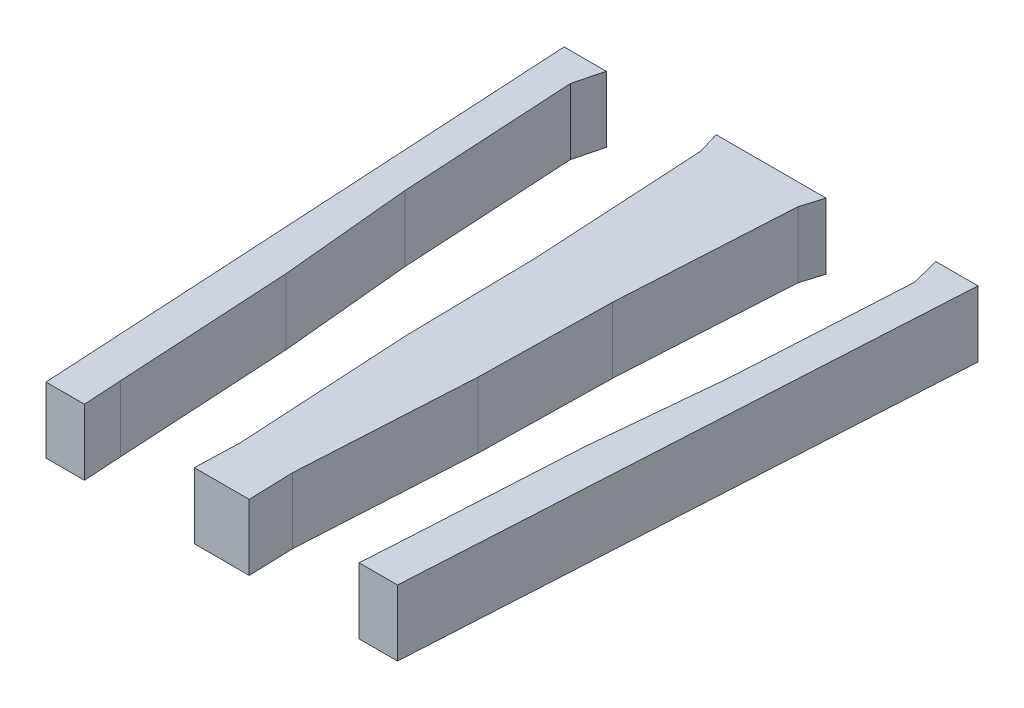
ISO-10303-21;
HEADER;
FILE_DESCRIPTION(('STEP AP214'),'2;1');
FILE_NAME('part.step','',(''),(''),'','','');
FILE_SCHEMA(('AUTOMOTIVE_DESIGN { 1 0 10303 214 1 1 1 1 }'));
ENDSEC;
DATA;
#1=APPLICATION_CONTEXT('core data for automotive mechanical design processes');
#2=APPLICATION_PROTOCOL_DEFINITION('international standard','automotive_design',2000,#1);
#3=PRODUCT_CONTEXT('',#1,'mechanical');
#4=PRODUCT('Part','Part','',(#3));
#5=PRODUCT_RELATED_PRODUCT_CATEGORY('part','',(#4));
#6=PRODUCT_DEFINITION_FORMATION('','',#4);
#7=PRODUCT_DEFINITION_CONTEXT('part definition',#1,'design');
#8=PRODUCT_DEFINITION('design','',#6,#7);
#9=PRODUCT_DEFINITION_SHAPE('','',#8);
#10=(LENGTH_UNIT() NAMED_UNIT(*) SI_UNIT(.MILLI.,.METRE.));
#11=(NAMED_UNIT(*) PLANE_ANGLE_UNIT() SI_UNIT($,.RADIAN.));
#12=(NAMED_UNIT(*) SI_UNIT($,.STERADIAN.) SOLID_ANGLE_UNIT());
#13=UNCERTAINTY_MEASURE_WITH_UNIT(LENGTH_MEASURE(1.E-05),#10,'distance_accuracy_value','');
#14=(GEOMETRIC_REPRESENTATION_CONTEXT(3) GLOBAL_UNCERTAINTY_ASSIGNED_CONTEXT((#13)) GLOBAL_UNIT_ASSIGNED_CONTEXT((#10,
#11,#12)) REPRESENTATION_CONTEXT('',''));
#15=CARTESIAN_POINT('',(0.,0.,0.));
#16=DIRECTION('',(0.,0.,1.));
#17=DIRECTION('',(1.,0.,0.));
#18=AXIS2_PLACEMENT_3D('',#15,#16,#17);
#19=CARTESIAN_POINT('',(2.81546451097174,0.,0.159873660928727));
#20=DIRECTION('',(-0.998391670557349,0.,-0.056692787563378));
#21=DIRECTION('',(0.056692787563378,0.,-0.998391670557349));
#22=AXIS2_PLACEMENT_3D('',#19,#20,#21);
#23=PLANE('',#22);
#24=DIRECTION('',(0.,1.,0.));
#25=VECTOR('',#24,1.);
#26=CARTESIAN_POINT('',(7.37923390982367,0.,-80.2106558189379));
#27=LINE('',#26,#25);
#28=CARTESIAN_POINT('',(7.37923390982367,0.,-80.2106558189379));
#29=VERTEX_POINT('',#28);
#30=CARTESIAN_POINT('',(7.37923390982367,3.,-80.2106558189379));
#31=VERTEX_POINT('',#30);
#32=EDGE_CURVE('E154',#29,#31,#27,.T.);
#33=ORIENTED_EDGE('',*,*,#32,.T.);
#34=DIRECTION('',(-0.056692787563378,0.,0.998391670557349));
#35=VECTOR('',#34,1.);
#36=CARTESIAN_POINT('',(2.81546451097174,3.,0.159873660928727));
#37=LINE('',#36,#35);
#38=CARTESIAN_POINT('',(7.8327762103307,3.,-88.1977891833967));
#39=VERTEX_POINT('',#38);
#40=EDGE_CURVE('E142',#39,#31,#37,.T.);
#41=ORIENTED_EDGE('',*,*,#40,.F.);
#42=DIRECTION('',(0.,1.,0.));
#43=VECTOR('',#42,1.);
#44=CARTESIAN_POINT('',(7.8327762103307,0.,-88.1977891833967));
#45=LINE('',#44,#43);
#46=CARTESIAN_POINT('',(7.8327762103307,0.,-88.1977891833967));
#47=VERTEX_POINT('',#46);
#48=EDGE_CURVE('E144',#47,#39,#45,.T.);
#49=ORIENTED_EDGE('',*,*,#48,.F.);
#50=DIRECTION('',(0.056692787563378,0.,-0.998391670557349));
#51=VECTOR('',#50,1.);
#52=CARTESIAN_POINT('',(2.81546451097174,0.,0.159873660928727));
#53=LINE('',#52,#51);
#54=EDGE_CURVE('E149',#29,#47,#53,.T.);
#55=ORIENTED_EDGE('',*,*,#54,.F.);
#56=EDGE_LOOP('',(#33,#41,#49,#55));
#57=FACE_BOUND('',#56,.T.);
#58=ADVANCED_FACE('F44',(#57),#23,.T.);
#59=CARTESIAN_POINT('',(7.50000000000001,0.,-89.5));
#60=DIRECTION('',(0.968864748878336,0.,-0.247590586212236));
#61=DIRECTION('',(0.247590586212236,0.,0.968864748878336));
#62=AXIS2_PLACEMENT_3D('',#59,#60,#61);
#63=PLANE('',#62);
#64=ORIENTED_EDGE('',*,*,#48,.T.);
#65=DIRECTION('',(-0.247590586212236,0.,-0.968864748878336));
#66=VECTOR('',#65,1.);
#67=CARTESIAN_POINT('',(28.5096620687398,3.,-7.28556173860592));
#68=LINE('',#67,#66);
#69=CARTESIAN_POINT('',(7.50000000000001,3.,-89.5));
#70=VERTEX_POINT('',#69);
#71=EDGE_CURVE('E80',#39,#70,#68,.T.);
#72=ORIENTED_EDGE('',*,*,#71,.T.);
#73=DIRECTION('',(0.,1.,0.));
#74=VECTOR('',#73,1.);
#75=CARTESIAN_POINT('',(7.50000000000001,0.,-89.5));
#76=LINE('',#75,#74);
#77=CARTESIAN_POINT('',(7.50000000000001,0.,-89.5));
#78=VERTEX_POINT('',#77);
#79=EDGE_CURVE('E169',#78,#70,#76,.T.);
#80=ORIENTED_EDGE('',*,*,#79,.F.);
#81=DIRECTION('',(0.247590586212236,0.,0.968864748878336));
#82=VECTOR('',#81,1.);
#83=CARTESIAN_POINT('',(7.50000000000001,0.,-89.5));
#84=LINE('',#83,#82);
#85=EDGE_CURVE('E172',#78,#47,#84,.T.);
#86=ORIENTED_EDGE('',*,*,#85,.T.);
#87=EDGE_LOOP('',(#64,#72,#80,#86));
#88=FACE_BOUND('',#87,.T.);
#89=ADVANCED_FACE('F187',(#88),#63,.F.);
#90=CARTESIAN_POINT('',(9.41960287819031,3.,-89.5));
#91=DIRECTION('',(0.,0.,1.));
#92=DIRECTION('',(-1.,0.,0.));
#93=AXIS2_PLACEMENT_3D('',#90,#91,#92);
#94=PLANE('',#93);
#95=DIRECTION('',(1.,0.,0.));
#96=VECTOR('',#95,1.);
#97=CARTESIAN_POINT('',(9.41960287819031,3.,-89.5));
#98=LINE('',#97,#96);
#99=CARTESIAN_POINT('',(9.41960287819031,3.,-89.5));
#100=VERTEX_POINT('',#99);
#101=EDGE_CURVE('E131',#70,#100,#98,.T.);
#102=ORIENTED_EDGE('',*,*,#101,.T.);
#103=DIRECTION('',(0.,-1.,0.));
#104=VECTOR('',#103,1.);
#105=CARTESIAN_POINT('',(9.41960287819031,3.,-89.5));
#106=LINE('',#105,#104);
#107=CARTESIAN_POINT('',(9.41960287819031,0.,-89.5));
#108=VERTEX_POINT('',#107);
#109=EDGE_CURVE('E12',#100,#108,#106,.T.);
#110=ORIENTED_EDGE('',*,*,#109,.T.);
#111=DIRECTION('',(1.,0.,0.));
#112=VECTOR('',#111,1.);
#113=CARTESIAN_POINT('',(9.41960287819031,0.,-89.5));
#114=LINE('',#113,#112);
#115=EDGE_CURVE('E136',#78,#108,#114,.T.);
#116=ORIENTED_EDGE('',*,*,#115,.F.);
#117=ORIENTED_EDGE('',*,*,#79,.T.);
#118=EDGE_LOOP('',(#102,#110,#116,#117));
#119=FACE_BOUND('',#118,.T.);
#120=ADVANCED_FACE('F46',(#119),#94,.F.);
#121=CARTESIAN_POINT('',(9.41960287819031,3.,-89.5));
#122=DIRECTION('',(-0.998391670557349,0.,-0.0566927875633779));
#123=DIRECTION('',(0.0566927875633779,0.,-0.998391670557349));
#124=AXIS2_PLACEMENT_3D('',#121,#122,#123);
#125=PLANE('',#124);
#126=DIRECTION('',(-0.0566927875633779,0.,0.998391670557349));
#127=VECTOR('',#126,1.);
#128=CARTESIAN_POINT('',(9.41960287819031,0.,-89.5));
#129=LINE('',#128,#127);
#130=CARTESIAN_POINT('',(8.,0.,-64.5));
#131=VERTEX_POINT('',#130);
#132=EDGE_CURVE('E72',#108,#131,#129,.T.);
#133=ORIENTED_EDGE('',*,*,#132,.F.);
#134=ORIENTED_EDGE('',*,*,#109,.F.);
#135=DIRECTION('',(-0.0566927875633779,0.,0.998391670557349));
#136=VECTOR('',#135,1.);
#137=CARTESIAN_POINT('',(9.41960287819031,3.,-89.5));
#138=LINE('',#137,#136);
#139=CARTESIAN_POINT('',(8.,3.,-64.5));
#140=VERTEX_POINT('',#139);
#141=EDGE_CURVE('E134',#100,#140,#138,.T.);
#142=ORIENTED_EDGE('',*,*,#141,.T.);
#143=DIRECTION('',(0.,-1.,0.));
#144=VECTOR('',#143,1.);
#145=CARTESIAN_POINT('',(8.,3.,-64.5));
#146=LINE('',#145,#144);
#147=EDGE_CURVE('E53',#140,#131,#146,.T.);
#148=ORIENTED_EDGE('',*,*,#147,.T.);
#149=EDGE_LOOP('',(#133,#134,#142,#148));
#150=FACE_BOUND('',#149,.T.);
#151=ADVANCED_FACE('F190',(#150),#125,.F.);
#152=CARTESIAN_POINT('',(6.80944710021522,0.,-74.2333451367334));
#153=DIRECTION('',(-0.995487308879439,0.,-0.0948947725639933));
#154=DIRECTION('',(0.0948947725639933,0.,-0.995487308879439));
#155=AXIS2_PLACEMENT_3D('',#152,#153,#154);
#156=PLANE('',#155);
#157=DIRECTION('',(0.0948947725639933,0.,-0.995487308879439));
#158=VECTOR('',#157,1.);
#159=CARTESIAN_POINT('',(6.80944710021522,3.,-74.2333451367334));
#160=LINE('',#159,#158);
#161=CARTESIAN_POINT('',(6.80944710021522,3.,-74.2333451367334));
#162=VERTEX_POINT('',#161);
#163=EDGE_CURVE('E161',#162,#31,#160,.T.);
#164=ORIENTED_EDGE('',*,*,#163,.T.);
#165=ORIENTED_EDGE('',*,*,#32,.F.);
#166=DIRECTION('',(0.0948947725639933,0.,-0.995487308879439));
#167=VECTOR('',#166,1.);
#168=CARTESIAN_POINT('',(6.80944710021522,0.,-74.2333451367334));
#169=LINE('',#168,#167);
#170=CARTESIAN_POINT('',(6.80944710021522,0.,-74.2333451367334));
#171=VERTEX_POINT('',#170);
#172=EDGE_CURVE('E157',#171,#29,#169,.T.);
#173=ORIENTED_EDGE('',*,*,#172,.F.);
#174=DIRECTION('',(0.,1.,0.));
#175=VECTOR('',#174,1.);
#176=CARTESIAN_POINT('',(6.80944710021522,0.,-74.2333451367334));
#177=LINE('',#176,#175);
#178=EDGE_CURVE('E156',#171,#162,#177,.T.);
#179=ORIENTED_EDGE('',*,*,#178,.T.);
#180=EDGE_LOOP('',(#164,#165,#173,#179));
#181=FACE_BOUND('',#180,.T.);
#182=ADVANCED_FACE('F181',(#181),#156,.T.);
#183=CARTESIAN_POINT('',(6.35590479970819,0.,-66.2462117722746));
#184=DIRECTION('',(-0.998391670557349,0.,-0.0566927875633782));
#185=DIRECTION('',(0.0566927875633782,0.,-0.998391670557349));
#186=AXIS2_PLACEMENT_3D('',#183,#184,#185);
#187=PLANE('',#186);
#188=DIRECTION('',(0.0566927875633782,0.,-0.998391670557349));
#189=VECTOR('',#188,1.);
#190=CARTESIAN_POINT('',(6.35590479970819,3.,-66.2462117722746));
#191=LINE('',#190,#189);
#192=CARTESIAN_POINT('',(6.35590479970819,3.,-66.2462117722746));
#193=VERTEX_POINT('',#192);
#194=EDGE_CURVE('E164',#193,#162,#191,.T.);
#195=ORIENTED_EDGE('',*,*,#194,.T.);
#196=ORIENTED_EDGE('',*,*,#178,.F.);
#197=DIRECTION('',(0.0566927875633782,0.,-0.998391670557349));
#198=VECTOR('',#197,1.);
#199=CARTESIAN_POINT('',(6.35590479970819,0.,-66.2462117722746));
#200=LINE('',#199,#198);
#201=CARTESIAN_POINT('',(6.35590479970819,0.,-66.2462117722746));
#202=VERTEX_POINT('',#201);
#203=EDGE_CURVE('E163',#202,#171,#200,.T.);
#204=ORIENTED_EDGE('',*,*,#203,.F.);
#205=DIRECTION('',(0.,1.,0.));
#206=VECTOR('',#205,1.);
#207=CARTESIAN_POINT('',(6.35590479970819,0.,-66.2462117722746));
#208=LINE('',#207,#206);
#209=EDGE_CURVE('E120',#202,#193,#208,.T.);
#210=ORIENTED_EDGE('',*,*,#209,.T.);
#211=EDGE_LOOP('',(#195,#196,#204,#210));
#212=FACE_BOUND('',#211,.T.);
#213=ADVANCED_FACE('F176',(#212),#187,.T.);
#214=CARTESIAN_POINT('',(0.,3.,-64.5));
#215=DIRECTION('',(0.,0.,-1.));
#216=DIRECTION('',(1.,0.,0.));
#217=AXIS2_PLACEMENT_3D('',#214,#215,#216);
#218=PLANE('',#217);
#219=DIRECTION('',(-1.,0.,0.));
#220=VECTOR('',#219,1.);
#221=CARTESIAN_POINT('',(0.,0.,-64.5));
#222=LINE('',#221,#220);
#223=CARTESIAN_POINT('',(6.25,0.,-64.5));
#224=VERTEX_POINT('',#223);
#225=EDGE_CURVE('E127',#131,#224,#222,.T.);
#226=ORIENTED_EDGE('',*,*,#225,.F.);
#227=ORIENTED_EDGE('',*,*,#147,.F.);
#228=DIRECTION('',(-1.,0.,0.));
#229=VECTOR('',#228,1.);
#230=CARTESIAN_POINT('',(0.,3.,-64.5));
#231=LINE('',#230,#229);
#232=CARTESIAN_POINT('',(6.25,3.,-64.5));
#233=VERTEX_POINT('',#232);
#234=EDGE_CURVE('E61',#140,#233,#231,.T.);
#235=ORIENTED_EDGE('',*,*,#234,.T.);
#236=DIRECTION('',(0.,1.,0.));
#237=VECTOR('',#236,1.);
#238=CARTESIAN_POINT('',(6.25,0.,-64.5));
#239=LINE('',#238,#237);
#240=EDGE_CURVE('E118',#224,#233,#239,.T.);
#241=ORIENTED_EDGE('',*,*,#240,.F.);
#242=EDGE_LOOP('',(#226,#227,#235,#241));
#243=FACE_BOUND('',#242,.T.);
#244=ADVANCED_FACE('F126',(#243),#218,.F.);
#245=CARTESIAN_POINT('',(0.,0.,0.));
#246=DIRECTION('',(0.,-1.,0.));
#247=DIRECTION('',(0.,0.,-1.));
#248=AXIS2_PLACEMENT_3D('',#245,#246,#247);
#249=PLANE('',#248);
#250=DIRECTION('',(-0.0605370818029849,0.,0.998165948991839));
#251=VECTOR('',#250,1.);
#252=CARTESIAN_POINT('',(6.35590479970819,0.,-66.2462117722746));
#253=LINE('',#252,#251);
#254=EDGE_CURVE('E115',#202,#224,#253,.T.);
#255=ORIENTED_EDGE('',*,*,#254,.F.);
#256=ORIENTED_EDGE('',*,*,#203,.T.);
#257=ORIENTED_EDGE('',*,*,#172,.T.);
#258=ORIENTED_EDGE('',*,*,#54,.T.);
#259=ORIENTED_EDGE('',*,*,#85,.F.);
#260=ORIENTED_EDGE('',*,*,#115,.T.);
#261=ORIENTED_EDGE('',*,*,#132,.T.);
#262=ORIENTED_EDGE('',*,*,#225,.T.);
#263=EDGE_LOOP('',(#255,#256,#257,#258,#259,#260,#261,#262));
#264=FACE_BOUND('',#263,.T.);
#265=ADVANCED_FACE('F130',(#264),#249,.T.);
#266=CARTESIAN_POINT('',(0.,3.,0.));
#267=DIRECTION('',(0.,-1.,0.));
#268=DIRECTION('',(0.,0.,-1.));
#269=AXIS2_PLACEMENT_3D('',#266,#267,#268);
#270=PLANE('',#269);
#271=ORIENTED_EDGE('',*,*,#234,.F.);
#272=ORIENTED_EDGE('',*,*,#141,.F.);
#273=ORIENTED_EDGE('',*,*,#101,.F.);
#274=ORIENTED_EDGE('',*,*,#71,.F.);
#275=ORIENTED_EDGE('',*,*,#40,.T.);
#276=ORIENTED_EDGE('',*,*,#163,.F.);
#277=ORIENTED_EDGE('',*,*,#194,.F.);
#278=DIRECTION('',(0.0605370818029849,0.,-0.998165948991839));
#279=VECTOR('',#278,1.);
#280=CARTESIAN_POINT('',(2.32961492168616,3.,0.141287217046433));
#281=LINE('',#280,#279);
#282=EDGE_CURVE('E128',#233,#193,#281,.T.);
#283=ORIENTED_EDGE('',*,*,#282,.F.);
#284=EDGE_LOOP('',(#271,#272,#273,#274,#275,#276,#277,#283));
#285=FACE_BOUND('',#284,.T.);
#286=ADVANCED_FACE('F178',(#285),#270,.F.);
#287=CARTESIAN_POINT('',(6.35590479970819,0.,-66.2462117722746));
#288=DIRECTION('',(0.998165948991839,0.,0.0605370818029849));
#289=DIRECTION('',(-0.0605370818029849,0.,0.998165948991839));
#290=AXIS2_PLACEMENT_3D('',#287,#288,#289);
#291=PLANE('',#290);
#292=ORIENTED_EDGE('',*,*,#240,.T.);
#293=ORIENTED_EDGE('',*,*,#282,.T.);
#294=ORIENTED_EDGE('',*,*,#209,.F.);
#295=ORIENTED_EDGE('',*,*,#254,.T.);
#296=EDGE_LOOP('',(#292,#293,#294,#295));
#297=FACE_BOUND('',#296,.T.);
#298=ADVANCED_FACE('F117',(#297),#291,.F.);
#299=CLOSED_SHELL('',(#58,#89,#120,#151,#182,#213,#244,#265,#286,#298));
#300=MANIFOLD_SOLID_BREP('B2',#299);
#301=CARTESIAN_POINT('',(0.,3.,0.));
#302=DIRECTION('',(0.,-1.,0.));
#303=DIRECTION('',(0.,0.,-1.));
#304=AXIS2_PLACEMENT_3D('',#301,#302,#303);
#305=PLANE('',#304);
#306=DIRECTION('',(-0.0566927875633779,0.,-0.998391670557349));
#307=VECTOR('',#306,1.);
#308=CARTESIAN_POINT('',(-1.18423594622109,3.,-66.5398804118529));
#309=LINE('',#308,#307);
#310=CARTESIAN_POINT('',(-1.18423594622134,3.,-66.5398804118529));
#311=VERTEX_POINT('',#310);
#312=CARTESIAN_POINT('',(-1.63777824672811,3.,-74.5270137763117));
#313=VERTEX_POINT('',#312);
#314=EDGE_CURVE('E394',#311,#313,#309,.T.);
#315=ORIENTED_EDGE('',*,*,#314,.F.);
#316=DIRECTION('',(-0.0322224301065761,0.,0.999480722674543));
#317=VECTOR('',#316,1.);
#318=CARTESIAN_POINT('',(-3.3259696472842,3.,-0.107226504788833));
#319=LINE('',#318,#317);
#320=CARTESIAN_POINT('',(-1.25,3.,-64.5));
#321=VERTEX_POINT('',#320);
#322=EDGE_CURVE('E310',#311,#321,#319,.T.);
#323=ORIENTED_EDGE('',*,*,#322,.T.);
#324=DIRECTION('',(1.,0.,0.));
#325=VECTOR('',#324,1.);
#326=CARTESIAN_POINT('',(0.,3.,-64.5));
#327=LINE('',#326,#325);
#328=CARTESIAN_POINT('',(1.25,3.,-64.5));
#329=VERTEX_POINT('',#328);
#330=EDGE_CURVE('E363',#321,#329,#327,.T.);
#331=ORIENTED_EDGE('',*,*,#330,.T.);
#332=DIRECTION('',(0.0322224301065761,0.,0.999480722674543));
#333=VECTOR('',#332,1.);
#334=CARTESIAN_POINT('',(3.3259696472842,3.,-0.107226504788833));
#335=LINE('',#334,#333);
#336=CARTESIAN_POINT('',(1.18423594622134,3.,-66.5398804118529));
#337=VERTEX_POINT('',#336);
#338=EDGE_CURVE('E411',#337,#329,#335,.T.);
#339=ORIENTED_EDGE('',*,*,#338,.F.);
#340=DIRECTION('',(0.0566927875633779,0.,-0.998391670557349));
#341=VECTOR('',#340,1.);
#342=CARTESIAN_POINT('',(1.18423594622109,3.,-66.5398804118529));
#343=LINE('',#342,#341);
#344=CARTESIAN_POINT('',(1.63777824672811,3.,-74.5270137763117));
#345=VERTEX_POINT('',#344);
#346=EDGE_CURVE('E435',#337,#345,#343,.T.);
#347=ORIENTED_EDGE('',*,*,#346,.T.);
#348=DIRECTION('',(0.0184075873599039,0.,-0.999830566009855));
#349=VECTOR('',#348,1.);
#350=CARTESIAN_POINT('',(1.63777824672811,3.,-74.5270137763117));
#351=LINE('',#350,#349);
#352=CARTESIAN_POINT('',(1.74830488788019,3.,-80.5304031407953));
#353=VERTEX_POINT('',#352);
#354=EDGE_CURVE('E430',#345,#353,#351,.T.);
#355=ORIENTED_EDGE('',*,*,#354,.T.);
#356=DIRECTION('',(-0.056692787563378,0.,0.998391670557349));
#357=VECTOR('',#356,1.);
#358=CARTESIAN_POINT('',(-2.81546451097171,3.,-0.159873660928725));
#359=LINE('',#358,#357);
#360=CARTESIAN_POINT('',(2.20184718838725,3.,-88.5175365052541));
#361=VERTEX_POINT('',#360);
#362=EDGE_CURVE('E408',#361,#353,#359,.T.);
#363=ORIENTED_EDGE('',*,*,#362,.F.);
#364=DIRECTION('',(-0.290396850069871,0.,0.956906301300967));
#365=VECTOR('',#364,1.);
#366=CARTESIAN_POINT('',(-22.5813163523544,3.,-6.85285814320552));
#367=LINE('',#366,#365);
#368=CARTESIAN_POINT('',(2.5,3.,-89.5));
#369=VERTEX_POINT('',#368);
#370=EDGE_CURVE('E414',#369,#361,#367,.T.);
#371=ORIENTED_EDGE('',*,*,#370,.F.);
#372=DIRECTION('',(-1.,0.,0.));
#373=VECTOR('',#372,1.);
#374=CARTESIAN_POINT('',(-9.41960287819031,3.,-89.5));
#375=LINE('',#374,#373);
#376=CARTESIAN_POINT('',(-2.5,3.,-89.5));
#377=VERTEX_POINT('',#376);
#378=EDGE_CURVE('E376',#369,#377,#375,.T.);
#379=ORIENTED_EDGE('',*,*,#378,.T.);
#380=DIRECTION('',(0.290396850069871,0.,0.956906301300967));
#381=VECTOR('',#380,1.);
#382=CARTESIAN_POINT('',(22.5813163523544,3.,-6.85285814320552));
#383=LINE('',#382,#381);
#384=CARTESIAN_POINT('',(-2.20184718838725,3.,-88.5175365052541));
#385=VERTEX_POINT('',#384);
#386=EDGE_CURVE('E379',#377,#385,#383,.T.);
#387=ORIENTED_EDGE('',*,*,#386,.T.);
#388=DIRECTION('',(0.056692787563378,0.,0.998391670557349));
#389=VECTOR('',#388,1.);
#390=CARTESIAN_POINT('',(2.81546451097171,3.,-0.159873660928725));
#391=LINE('',#390,#389);
#392=CARTESIAN_POINT('',(-1.74830488788019,3.,-80.5304031407953));
#393=VERTEX_POINT('',#392);
#394=EDGE_CURVE('E353',#385,#393,#391,.T.);
#395=ORIENTED_EDGE('',*,*,#394,.T.);
#396=DIRECTION('',(-0.0184075873599039,0.,-0.999830566009855));
#397=VECTOR('',#396,1.);
#398=CARTESIAN_POINT('',(-1.63777824672811,3.,-74.5270137763117));
#399=LINE('',#398,#397);
#400=EDGE_CURVE('E391',#313,#393,#399,.T.);
#401=ORIENTED_EDGE('',*,*,#400,.F.);
#402=EDGE_LOOP('',(#315,#323,#331,#339,#347,#355,#363,#371,#379,#387,#395,#401));
#403=FACE_BOUND('',#402,.T.);
#404=ADVANCED_FACE('F293',(#403),#305,.F.);
#405=CARTESIAN_POINT('',(0.,0.,0.));
#406=DIRECTION('',(0.,-1.,0.));
#407=DIRECTION('',(0.,0.,-1.));
#408=AXIS2_PLACEMENT_3D('',#405,#406,#407);
#409=PLANE('',#408);
#410=DIRECTION('',(0.0322224301065761,0.,-0.999480722674543));
#411=VECTOR('',#410,1.);
#412=CARTESIAN_POINT('',(-1.25,0.,-64.5));
#413=LINE('',#412,#411);
#414=CARTESIAN_POINT('',(-1.25,0.,-64.5));
#415=VERTEX_POINT('',#414);
#416=CARTESIAN_POINT('',(-1.18423594622134,0.,-66.5398804118529));
#417=VERTEX_POINT('',#416);
#418=EDGE_CURVE('E346',#415,#417,#413,.T.);
#419=ORIENTED_EDGE('',*,*,#418,.T.);
#420=DIRECTION('',(-0.0566927875633779,0.,-0.998391670557349));
#421=VECTOR('',#420,1.);
#422=CARTESIAN_POINT('',(-1.18423594622109,0.,-66.5398804118529));
#423=LINE('',#422,#421);
#424=CARTESIAN_POINT('',(-1.63777824672811,0.,-74.5270137763117));
#425=VERTEX_POINT('',#424);
#426=EDGE_CURVE('E352',#417,#425,#423,.T.);
#427=ORIENTED_EDGE('',*,*,#426,.T.);
#428=DIRECTION('',(-0.0184075873599039,0.,-0.999830566009855));
#429=VECTOR('',#428,1.);
#430=CARTESIAN_POINT('',(-1.63777824672811,0.,-74.5270137763117));
#431=LINE('',#430,#429);
#432=CARTESIAN_POINT('',(-1.74830488788019,0.,-80.5304031407953));
#433=VERTEX_POINT('',#432);
#434=EDGE_CURVE('E388',#425,#433,#431,.T.);
#435=ORIENTED_EDGE('',*,*,#434,.T.);
#436=DIRECTION('',(-0.056692787563378,0.,-0.998391670557349));
#437=VECTOR('',#436,1.);
#438=CARTESIAN_POINT('',(2.81546451097171,0.,-0.159873660928725));
#439=LINE('',#438,#437);
#440=CARTESIAN_POINT('',(-2.20184718838725,0.,-88.5175365052541));
#441=VERTEX_POINT('',#440);
#442=EDGE_CURVE('E373',#433,#441,#439,.T.);
#443=ORIENTED_EDGE('',*,*,#442,.T.);
#444=DIRECTION('',(-0.290396850069871,0.,-0.956906301300967));
#445=VECTOR('',#444,1.);
#446=CARTESIAN_POINT('',(-2.20184718838725,0.,-88.5175365052541));
#447=LINE('',#446,#445);
#448=CARTESIAN_POINT('',(-2.5,0.,-89.5));
#449=VERTEX_POINT('',#448);
#450=EDGE_CURVE('E369',#441,#449,#447,.T.);
#451=ORIENTED_EDGE('',*,*,#450,.T.);
#452=DIRECTION('',(-1.,0.,0.));
#453=VECTOR('',#452,1.);
#454=CARTESIAN_POINT('',(-9.41960287819031,0.,-89.5));
#455=LINE('',#454,#453);
#456=CARTESIAN_POINT('',(2.5,0.,-89.5));
#457=VERTEX_POINT('',#456);
#458=EDGE_CURVE('E296',#457,#449,#455,.T.);
#459=ORIENTED_EDGE('',*,*,#458,.F.);
#460=DIRECTION('',(0.290396850069871,0.,-0.956906301300967));
#461=VECTOR('',#460,1.);
#462=CARTESIAN_POINT('',(2.20184718838725,0.,-88.5175365052541));
#463=LINE('',#462,#461);
#464=CARTESIAN_POINT('',(2.20184718838725,0.,-88.5175365052541));
#465=VERTEX_POINT('',#464);
#466=EDGE_CURVE('E415',#465,#457,#463,.T.);
#467=ORIENTED_EDGE('',*,*,#466,.F.);
#468=DIRECTION('',(0.056692787563378,0.,-0.998391670557349));
#469=VECTOR('',#468,1.);
#470=CARTESIAN_POINT('',(-2.81546451097171,0.,-0.159873660928725));
#471=LINE('',#470,#469);
#472=CARTESIAN_POINT('',(1.74830488788019,0.,-80.5304031407953));
#473=VERTEX_POINT('',#472);
#474=EDGE_CURVE('E419',#473,#465,#471,.T.);
#475=ORIENTED_EDGE('',*,*,#474,.F.);
#476=DIRECTION('',(0.0184075873599039,0.,-0.999830566009855));
#477=VECTOR('',#476,1.);
#478=CARTESIAN_POINT('',(1.63777824672811,0.,-74.5270137763117));
#479=LINE('',#478,#477);
#480=CARTESIAN_POINT('',(1.63777824672811,0.,-74.5270137763117));
#481=VERTEX_POINT('',#480);
#482=EDGE_CURVE('E425',#481,#473,#479,.T.);
#483=ORIENTED_EDGE('',*,*,#482,.F.);
#484=DIRECTION('',(0.0566927875633779,0.,-0.998391670557349));
#485=VECTOR('',#484,1.);
#486=CARTESIAN_POINT('',(1.18423594622109,0.,-66.5398804118529));
#487=LINE('',#486,#485);
#488=CARTESIAN_POINT('',(1.18423594622134,0.,-66.5398804118529));
#489=VERTEX_POINT('',#488);
#490=EDGE_CURVE('E407',#489,#481,#487,.T.);
#491=ORIENTED_EDGE('',*,*,#490,.F.);
#492=DIRECTION('',(-0.0322224301065761,0.,-0.999480722674543));
#493=VECTOR('',#492,1.);
#494=CARTESIAN_POINT('',(1.25,0.,-64.5));
#495=LINE('',#494,#493);
#496=CARTESIAN_POINT('',(1.25,0.,-64.5));
#497=VERTEX_POINT('',#496);
#498=EDGE_CURVE('E368',#497,#489,#495,.T.);
#499=ORIENTED_EDGE('',*,*,#498,.F.);
#500=DIRECTION('',(1.,0.,0.));
#501=VECTOR('',#500,1.);
#502=CARTESIAN_POINT('',(0.,0.,-64.5));
#503=LINE('',#502,#501);
#504=EDGE_CURVE('E360',#415,#497,#503,.T.);
#505=ORIENTED_EDGE('',*,*,#504,.F.);
#506=EDGE_LOOP('',(#419,#427,#435,#443,#451,#459,#467,#475,#483,#491,#499,#505));
#507=FACE_BOUND('',#506,.T.);
#508=ADVANCED_FACE('F365',(#507),#409,.T.);
#509=CARTESIAN_POINT('',(0.,3.,-64.5));
#510=DIRECTION('',(0.,0.,-1.));
#511=DIRECTION('',(-1.,0.,0.));
#512=AXIS2_PLACEMENT_3D('',#509,#510,#511);
#513=PLANE('',#512);
#514=ORIENTED_EDGE('',*,*,#330,.F.);
#515=DIRECTION('',(0.,1.,0.));
#516=VECTOR('',#515,1.);
#517=CARTESIAN_POINT('',(-1.25,0.,-64.5));
#518=LINE('',#517,#516);
#519=EDGE_CURVE('E42',#415,#321,#518,.T.);
#520=ORIENTED_EDGE('',*,*,#519,.F.);
#521=ORIENTED_EDGE('',*,*,#504,.T.);
#522=DIRECTION('',(0.,1.,0.));
#523=VECTOR('',#522,1.);
#524=CARTESIAN_POINT('',(1.25,0.,-64.5));
#525=LINE('',#524,#523);
#526=EDGE_CURVE('E381',#497,#329,#525,.T.);
#527=ORIENTED_EDGE('',*,*,#526,.T.);
#528=EDGE_LOOP('',(#514,#520,#521,#527));
#529=FACE_BOUND('',#528,.T.);
#530=ADVANCED_FACE('F358',(#529),#513,.F.);
#531=CARTESIAN_POINT('',(-9.41960287819031,3.,-89.5));
#532=DIRECTION('',(0.,0.,1.));
#533=DIRECTION('',(1.,0.,0.));
#534=AXIS2_PLACEMENT_3D('',#531,#532,#533);
#535=PLANE('',#534);
#536=ORIENTED_EDGE('',*,*,#458,.T.);
#537=DIRECTION('',(0.,1.,0.));
#538=VECTOR('',#537,1.);
#539=CARTESIAN_POINT('',(-2.5,0.,-89.5));
#540=LINE('',#539,#538);
#541=EDGE_CURVE('E371',#449,#377,#540,.T.);
#542=ORIENTED_EDGE('',*,*,#541,.T.);
#543=ORIENTED_EDGE('',*,*,#378,.F.);
#544=DIRECTION('',(0.,1.,0.));
#545=VECTOR('',#544,1.);
#546=CARTESIAN_POINT('',(2.5,0.,-89.5));
#547=LINE('',#546,#545);
#548=EDGE_CURVE('E418',#457,#369,#547,.T.);
#549=ORIENTED_EDGE('',*,*,#548,.F.);
#550=EDGE_LOOP('',(#536,#542,#543,#549));
#551=FACE_BOUND('',#550,.T.);
#552=ADVANCED_FACE('F508',(#551),#535,.F.);
#553=CARTESIAN_POINT('',(2.81546451097171,0.,-0.159873660928725));
#554=DIRECTION('',(0.998391670557349,0.,-0.056692787563378));
#555=DIRECTION('',(-0.056692787563378,0.,-0.998391670557349));
#556=AXIS2_PLACEMENT_3D('',#553,#554,#555);
#557=PLANE('',#556);
#558=DIRECTION('',(0.,1.,0.));
#559=VECTOR('',#558,1.);
#560=CARTESIAN_POINT('',(-1.74830488788019,0.,-80.5304031407953));
#561=LINE('',#560,#559);
#562=EDGE_CURVE('E385',#433,#393,#561,.T.);
#563=ORIENTED_EDGE('',*,*,#562,.T.);
#564=ORIENTED_EDGE('',*,*,#394,.F.);
#565=DIRECTION('',(0.,1.,0.));
#566=VECTOR('',#565,1.);
#567=CARTESIAN_POINT('',(-2.20184718838725,0.,-88.5175365052541));
#568=LINE('',#567,#566);
#569=EDGE_CURVE('E302',#441,#385,#568,.T.);
#570=ORIENTED_EDGE('',*,*,#569,.F.);
#571=ORIENTED_EDGE('',*,*,#442,.F.);
#572=EDGE_LOOP('',(#563,#564,#570,#571));
#573=FACE_BOUND('',#572,.T.);
#574=ADVANCED_FACE('F503',(#573),#557,.F.);
#575=CARTESIAN_POINT('',(-1.18423594622109,0.,-66.5398804118529));
#576=DIRECTION('',(0.998391670557349,0.,-0.0566927875633779));
#577=DIRECTION('',(-0.0566927875633779,0.,-0.998391670557349));
#578=AXIS2_PLACEMENT_3D('',#575,#576,#577);
#579=PLANE('',#578);
#580=ORIENTED_EDGE('',*,*,#314,.T.);
#581=DIRECTION('',(0.,1.,0.));
#582=VECTOR('',#581,1.);
#583=CARTESIAN_POINT('',(-1.63777824672811,0.,-74.5270137763117));
#584=LINE('',#583,#582);
#585=EDGE_CURVE('E393',#425,#313,#584,.T.);
#586=ORIENTED_EDGE('',*,*,#585,.F.);
#587=ORIENTED_EDGE('',*,*,#426,.F.);
#588=DIRECTION('',(0.,1.,0.));
#589=VECTOR('',#588,1.);
#590=CARTESIAN_POINT('',(-1.18423594622109,0.,-66.5398804118529));
#591=LINE('',#590,#589);
#592=EDGE_CURVE('E344',#417,#311,#591,.T.);
#593=ORIENTED_EDGE('',*,*,#592,.T.);
#594=EDGE_LOOP('',(#580,#586,#587,#593));
#595=FACE_BOUND('',#594,.T.);
#596=ADVANCED_FACE('F494',(#595),#579,.F.);
#597=CARTESIAN_POINT('',(-1.63777824672811,0.,-74.5270137763117));
#598=DIRECTION('',(0.999830566009855,0.,-0.0184075873599039));
#599=DIRECTION('',(-0.0184075873599039,0.,-0.999830566009855));
#600=AXIS2_PLACEMENT_3D('',#597,#598,#599);
#601=PLANE('',#600);
#602=ORIENTED_EDGE('',*,*,#400,.T.);
#603=ORIENTED_EDGE('',*,*,#562,.F.);
#604=ORIENTED_EDGE('',*,*,#434,.F.);
#605=ORIENTED_EDGE('',*,*,#585,.T.);
#606=EDGE_LOOP('',(#602,#603,#604,#605));
#607=FACE_BOUND('',#606,.T.);
#608=ADVANCED_FACE('F500',(#607),#601,.F.);
#609=CARTESIAN_POINT('',(-2.20184718838725,0.,-88.5175365052541));
#610=DIRECTION('',(0.956906301300967,0.,-0.290396850069871));
#611=DIRECTION('',(-0.290396850069871,0.,-0.956906301300967));
#612=AXIS2_PLACEMENT_3D('',#609,#610,#611);
#613=PLANE('',#612);
#614=ORIENTED_EDGE('',*,*,#541,.F.);
#615=ORIENTED_EDGE('',*,*,#450,.F.);
#616=ORIENTED_EDGE('',*,*,#569,.T.);
#617=ORIENTED_EDGE('',*,*,#386,.F.);
#618=EDGE_LOOP('',(#614,#615,#616,#617));
#619=FACE_BOUND('',#618,.T.);
#620=ADVANCED_FACE('F505',(#619),#613,.F.);
#621=CARTESIAN_POINT('',(-1.25,0.,-64.5));
#622=DIRECTION('',(0.999480722674543,0.,0.0322224301065761));
#623=DIRECTION('',(0.0322224301065761,0.,-0.999480722674543));
#624=AXIS2_PLACEMENT_3D('',#621,#622,#623);
#625=PLANE('',#624);
#626=ORIENTED_EDGE('',*,*,#592,.F.);
#627=ORIENTED_EDGE('',*,*,#418,.F.);
#628=ORIENTED_EDGE('',*,*,#519,.T.);
#629=ORIENTED_EDGE('',*,*,#322,.F.);
#630=EDGE_LOOP('',(#626,#627,#628,#629));
#631=FACE_BOUND('',#630,.T.);
#632=ADVANCED_FACE('F348',(#631),#625,.F.);
#633=CARTESIAN_POINT('',(-2.81546451097171,0.,-0.159873660928725));
#634=DIRECTION('',(-0.998391670557349,0.,-0.056692787563378));
#635=DIRECTION('',(0.056692787563378,0.,-0.998391670557349));
#636=AXIS2_PLACEMENT_3D('',#633,#634,#635);
#637=PLANE('',#636);
#638=DIRECTION('',(0.,1.,0.));
#639=VECTOR('',#638,1.);
#640=CARTESIAN_POINT('',(1.74830488788019,0.,-80.5304031407953));
#641=LINE('',#640,#639);
#642=EDGE_CURVE('E422',#473,#353,#641,.T.);
#643=ORIENTED_EDGE('',*,*,#642,.F.);
#644=ORIENTED_EDGE('',*,*,#474,.T.);
#645=DIRECTION('',(0.,1.,0.));
#646=VECTOR('',#645,1.);
#647=CARTESIAN_POINT('',(2.20184718838725,0.,-88.5175365052541));
#648=LINE('',#647,#646);
#649=EDGE_CURVE('E410',#465,#361,#648,.T.);
#650=ORIENTED_EDGE('',*,*,#649,.T.);
#651=ORIENTED_EDGE('',*,*,#362,.T.);
#652=EDGE_LOOP('',(#643,#644,#650,#651));
#653=FACE_BOUND('',#652,.T.);
#654=ADVANCED_FACE('F453',(#653),#637,.F.);
#655=CARTESIAN_POINT('',(1.18423594622109,0.,-66.5398804118529));
#656=DIRECTION('',(-0.998391670557349,0.,-0.0566927875633779));
#657=DIRECTION('',(0.0566927875633779,0.,-0.998391670557349));
#658=AXIS2_PLACEMENT_3D('',#655,#656,#657);
#659=PLANE('',#658);
#660=ORIENTED_EDGE('',*,*,#346,.F.);
#661=DIRECTION('',(0.,1.,0.));
#662=VECTOR('',#661,1.);
#663=CARTESIAN_POINT('',(1.18423594622109,0.,-66.5398804118529));
#664=LINE('',#663,#662);
#665=EDGE_CURVE('E434',#489,#337,#664,.T.);
#666=ORIENTED_EDGE('',*,*,#665,.F.);
#667=ORIENTED_EDGE('',*,*,#490,.T.);
#668=DIRECTION('',(0.,1.,0.));
#669=VECTOR('',#668,1.);
#670=CARTESIAN_POINT('',(1.63777824672811,0.,-74.5270137763117));
#671=LINE('',#670,#669);
#672=EDGE_CURVE('E433',#481,#345,#671,.T.);
#673=ORIENTED_EDGE('',*,*,#672,.T.);
#674=EDGE_LOOP('',(#660,#666,#667,#673));
#675=FACE_BOUND('',#674,.T.);
#676=ADVANCED_FACE('F486',(#675),#659,.F.);
#677=CARTESIAN_POINT('',(1.63777824672811,0.,-74.5270137763117));
#678=DIRECTION('',(-0.999830566009855,0.,-0.0184075873599039));
#679=DIRECTION('',(0.0184075873599039,0.,-0.999830566009855));
#680=AXIS2_PLACEMENT_3D('',#677,#678,#679);
#681=PLANE('',#680);
#682=ORIENTED_EDGE('',*,*,#354,.F.);
#683=ORIENTED_EDGE('',*,*,#672,.F.);
#684=ORIENTED_EDGE('',*,*,#482,.T.);
#685=ORIENTED_EDGE('',*,*,#642,.T.);
#686=EDGE_LOOP('',(#682,#683,#684,#685));
#687=FACE_BOUND('',#686,.T.);
#688=ADVANCED_FACE('F467',(#687),#681,.F.);
#689=CARTESIAN_POINT('',(2.20184718838725,0.,-88.5175365052541));
#690=DIRECTION('',(-0.956906301300967,0.,-0.290396850069871));
#691=DIRECTION('',(0.290396850069871,0.,-0.956906301300967));
#692=AXIS2_PLACEMENT_3D('',#689,#690,#691);
#693=PLANE('',#692);
#694=ORIENTED_EDGE('',*,*,#548,.T.);
#695=ORIENTED_EDGE('',*,*,#370,.T.);
#696=ORIENTED_EDGE('',*,*,#649,.F.);
#697=ORIENTED_EDGE('',*,*,#466,.T.);
#698=EDGE_LOOP('',(#694,#695,#696,#697));
#699=FACE_BOUND('',#698,.T.);
#700=ADVANCED_FACE('F510',(#699),#693,.F.);
#701=CARTESIAN_POINT('',(1.25,0.,-64.5));
#702=DIRECTION('',(-0.999480722674543,0.,0.0322224301065761));
#703=DIRECTION('',(-0.0322224301065761,0.,-0.999480722674543));
#704=AXIS2_PLACEMENT_3D('',#701,#702,#703);
#705=PLANE('',#704);
#706=ORIENTED_EDGE('',*,*,#665,.T.);
#707=ORIENTED_EDGE('',*,*,#338,.T.);
#708=ORIENTED_EDGE('',*,*,#526,.F.);
#709=ORIENTED_EDGE('',*,*,#498,.T.);
#710=EDGE_LOOP('',(#706,#707,#708,#709));
#711=FACE_BOUND('',#710,.T.);
#712=ADVANCED_FACE('F490',(#711),#705,.F.);
#713=CLOSED_SHELL('',(#404,#508,#530,#552,#574,#596,#608,#620,#632,#654,#676,#688,#700,#712));
#714=MANIFOLD_SOLID_BREP('B6',#713);
#715=CARTESIAN_POINT('',(-2.81546451097174,0.,0.159873660928727));
#716=DIRECTION('',(0.998391670557349,0.,-0.056692787563378));
#717=DIRECTION('',(-0.056692787563378,0.,-0.998391670557349));
#718=AXIS2_PLACEMENT_3D('',#715,#716,#717);
#719=PLANE('',#718);
#720=DIRECTION('',(0.,1.,0.));
#721=VECTOR('',#720,1.);
#722=CARTESIAN_POINT('',(-7.37923390982367,0.,-80.2106558189379));
#723=LINE('',#722,#721);
#724=CARTESIAN_POINT('',(-7.37923390982367,0.,-80.2106558189379));
#725=VERTEX_POINT('',#724);
#726=CARTESIAN_POINT('',(-7.37923390982367,3.,-80.2106558189379));
#727=VERTEX_POINT('',#726);
#728=EDGE_CURVE('E751',#725,#727,#723,.T.);
#729=ORIENTED_EDGE('',*,*,#728,.F.);
#730=DIRECTION('',(-0.056692787563378,0.,-0.998391670557349));
#731=VECTOR('',#730,1.);
#732=CARTESIAN_POINT('',(-2.81546451097174,0.,0.159873660928727));
#733=LINE('',#732,#731);
#734=CARTESIAN_POINT('',(-7.8327762103307,0.,-88.1977891833967));
#735=VERTEX_POINT('',#734);
#736=EDGE_CURVE('E746',#725,#735,#733,.T.);
#737=ORIENTED_EDGE('',*,*,#736,.T.);
#738=DIRECTION('',(0.,1.,0.));
#739=VECTOR('',#738,1.);
#740=CARTESIAN_POINT('',(-7.8327762103307,0.,-88.1977891833967));
#741=LINE('',#740,#739);
#742=CARTESIAN_POINT('',(-7.8327762103307,3.,-88.1977891833967));
#743=VERTEX_POINT('',#742);
#744=EDGE_CURVE('E741',#735,#743,#741,.T.);
#745=ORIENTED_EDGE('',*,*,#744,.T.);
#746=DIRECTION('',(0.056692787563378,0.,0.998391670557349));
#747=VECTOR('',#746,1.);
#748=CARTESIAN_POINT('',(-2.81546451097174,3.,0.159873660928727));
#749=LINE('',#748,#747);
#750=EDGE_CURVE('E739',#743,#727,#749,.T.);
#751=ORIENTED_EDGE('',*,*,#750,.T.);
#752=EDGE_LOOP('',(#729,#737,#745,#751));
#753=FACE_BOUND('',#752,.T.);
#754=ADVANCED_FACE('F637',(#753),#719,.T.);
#755=CARTESIAN_POINT('',(-7.50000000000001,0.,-89.5));
#756=DIRECTION('',(-0.968864748878336,0.,-0.247590586212236));
#757=DIRECTION('',(-0.247590586212236,0.,0.968864748878336));
#758=AXIS2_PLACEMENT_3D('',#755,#756,#757);
#759=PLANE('',#758);
#760=ORIENTED_EDGE('',*,*,#744,.F.);
#761=DIRECTION('',(-0.247590586212236,0.,0.968864748878336));
#762=VECTOR('',#761,1.);
#763=CARTESIAN_POINT('',(-7.50000000000001,0.,-89.5));
#764=LINE('',#763,#762);
#765=CARTESIAN_POINT('',(-7.50000000000001,0.,-89.5));
#766=VERTEX_POINT('',#765);
#767=EDGE_CURVE('E769',#766,#735,#764,.T.);
#768=ORIENTED_EDGE('',*,*,#767,.F.);
#769=DIRECTION('',(0.,1.,0.));
#770=VECTOR('',#769,1.);
#771=CARTESIAN_POINT('',(-7.50000000000001,0.,-89.5));
#772=LINE('',#771,#770);
#773=CARTESIAN_POINT('',(-7.50000000000001,3.,-89.5));
#774=VERTEX_POINT('',#773);
#775=EDGE_CURVE('E767',#766,#774,#772,.T.);
#776=ORIENTED_EDGE('',*,*,#775,.T.);
#777=DIRECTION('',(0.247590586212236,0.,-0.968864748878336));
#778=VECTOR('',#777,1.);
#779=CARTESIAN_POINT('',(-28.5096620687398,3.,-7.28556173860592));
#780=LINE('',#779,#778);
#781=EDGE_CURVE('E674',#743,#774,#780,.T.);
#782=ORIENTED_EDGE('',*,*,#781,.F.);
#783=EDGE_LOOP('',(#760,#768,#776,#782));
#784=FACE_BOUND('',#783,.T.);
#785=ADVANCED_FACE('F783',(#784),#759,.F.);
#786=CARTESIAN_POINT('',(-9.41960287819031,3.,-89.5));
#787=DIRECTION('',(0.,0.,1.));
#788=DIRECTION('',(1.,0.,0.));
#789=AXIS2_PLACEMENT_3D('',#786,#787,#788);
#790=PLANE('',#789);
#791=DIRECTION('',(-1.,0.,0.));
#792=VECTOR('',#791,1.);
#793=CARTESIAN_POINT('',(-9.41960287819031,3.,-89.5));
#794=LINE('',#793,#792);
#795=CARTESIAN_POINT('',(-9.41960287819031,3.,-89.5));
#796=VERTEX_POINT('',#795);
#797=EDGE_CURVE('E730',#774,#796,#794,.T.);
#798=ORIENTED_EDGE('',*,*,#797,.F.);
#799=ORIENTED_EDGE('',*,*,#775,.F.);
#800=DIRECTION('',(-1.,0.,0.));
#801=VECTOR('',#800,1.);
#802=CARTESIAN_POINT('',(-9.41960287819031,0.,-89.5));
#803=LINE('',#802,#801);
#804=CARTESIAN_POINT('',(-9.41960287819031,0.,-89.5));
#805=VERTEX_POINT('',#804);
#806=EDGE_CURVE('E665',#766,#805,#803,.T.);
#807=ORIENTED_EDGE('',*,*,#806,.T.);
#808=DIRECTION('',(0.,-1.,0.));
#809=VECTOR('',#808,1.);
#810=CARTESIAN_POINT('',(-9.41960287819031,3.,-89.5));
#811=LINE('',#810,#809);
#812=EDGE_CURVE('E291',#796,#805,#811,.T.);
#813=ORIENTED_EDGE('',*,*,#812,.F.);
#814=EDGE_LOOP('',(#798,#799,#807,#813));
#815=FACE_BOUND('',#814,.T.);
#816=ADVANCED_FACE('F639',(#815),#790,.F.);
#817=CARTESIAN_POINT('',(-9.41960287819031,3.,-89.5));
#818=DIRECTION('',(0.998391670557349,0.,-0.0566927875633779));
#819=DIRECTION('',(-0.0566927875633779,0.,-0.998391670557349));
#820=AXIS2_PLACEMENT_3D('',#817,#818,#819);
#821=PLANE('',#820);
#822=DIRECTION('',(0.0566927875633779,0.,0.998391670557349));
#823=VECTOR('',#822,1.);
#824=CARTESIAN_POINT('',(-9.41960287819031,0.,-89.5));
#825=LINE('',#824,#823);
#826=CARTESIAN_POINT('',(-8.,0.,-64.5));
#827=VERTEX_POINT('',#826);
#828=EDGE_CURVE('E731',#805,#827,#825,.T.);
#829=ORIENTED_EDGE('',*,*,#828,.T.);
#830=DIRECTION('',(0.,-1.,0.));
#831=VECTOR('',#830,1.);
#832=CARTESIAN_POINT('',(-8.,3.,-64.5));
#833=LINE('',#832,#831);
#834=CARTESIAN_POINT('',(-8.,3.,-64.5));
#835=VERTEX_POINT('',#834);
#836=EDGE_CURVE('E646',#835,#827,#833,.T.);
#837=ORIENTED_EDGE('',*,*,#836,.F.);
#838=DIRECTION('',(0.0566927875633779,0.,0.998391670557349));
#839=VECTOR('',#838,1.);
#840=CARTESIAN_POINT('',(-9.41960287819031,3.,-89.5));
#841=LINE('',#840,#839);
#842=EDGE_CURVE('E654',#796,#835,#841,.T.);
#843=ORIENTED_EDGE('',*,*,#842,.F.);
#844=ORIENTED_EDGE('',*,*,#812,.T.);
#845=EDGE_LOOP('',(#829,#837,#843,#844));
#846=FACE_BOUND('',#845,.T.);
#847=ADVANCED_FACE('F781',(#846),#821,.F.);
#848=CARTESIAN_POINT('',(-6.80944710021522,0.,-74.2333451367334));
#849=DIRECTION('',(0.995487308879439,0.,-0.0948947725639933));
#850=DIRECTION('',(-0.0948947725639933,0.,-0.995487308879439));
#851=AXIS2_PLACEMENT_3D('',#848,#849,#850);
#852=PLANE('',#851);
#853=DIRECTION('',(-0.0948947725639933,0.,-0.995487308879439));
#854=VECTOR('',#853,1.);
#855=CARTESIAN_POINT('',(-6.80944710021522,3.,-74.2333451367334));
#856=LINE('',#855,#854);
#857=CARTESIAN_POINT('',(-6.80944710021522,3.,-74.2333451367334));
#858=VERTEX_POINT('',#857);
#859=EDGE_CURVE('E758',#858,#727,#856,.T.);
#860=ORIENTED_EDGE('',*,*,#859,.F.);
#861=DIRECTION('',(0.,1.,0.));
#862=VECTOR('',#861,1.);
#863=CARTESIAN_POINT('',(-6.80944710021522,0.,-74.2333451367334));
#864=LINE('',#863,#862);
#865=CARTESIAN_POINT('',(-6.80944710021522,0.,-74.2333451367334));
#866=VERTEX_POINT('',#865);
#867=EDGE_CURVE('E754',#866,#858,#864,.T.);
#868=ORIENTED_EDGE('',*,*,#867,.F.);
#869=DIRECTION('',(-0.0948947725639933,0.,-0.995487308879439));
#870=VECTOR('',#869,1.);
#871=CARTESIAN_POINT('',(-6.80944710021522,0.,-74.2333451367334));
#872=LINE('',#871,#870);
#873=EDGE_CURVE('E755',#866,#725,#872,.T.);
#874=ORIENTED_EDGE('',*,*,#873,.T.);
#875=ORIENTED_EDGE('',*,*,#728,.T.);
#876=EDGE_LOOP('',(#860,#868,#874,#875));
#877=FACE_BOUND('',#876,.T.);
#878=ADVANCED_FACE('F778',(#877),#852,.T.);
#879=CARTESIAN_POINT('',(-6.35590479970819,0.,-66.2462117722746));
#880=DIRECTION('',(0.998391670557349,0.,-0.0566927875633782));
#881=DIRECTION('',(-0.0566927875633782,0.,-0.998391670557349));
#882=AXIS2_PLACEMENT_3D('',#879,#880,#881);
#883=PLANE('',#882);
#884=DIRECTION('',(-0.0566927875633782,0.,-0.998391670557349));
#885=VECTOR('',#884,1.);
#886=CARTESIAN_POINT('',(-6.35590479970819,3.,-66.2462117722746));
#887=LINE('',#886,#885);
#888=CARTESIAN_POINT('',(-6.35590479970819,3.,-66.2462117722746));
#889=VERTEX_POINT('',#888);
#890=EDGE_CURVE('E761',#889,#858,#887,.T.);
#891=ORIENTED_EDGE('',*,*,#890,.F.);
#892=DIRECTION('',(0.,1.,0.));
#893=VECTOR('',#892,1.);
#894=CARTESIAN_POINT('',(-6.35590479970819,0.,-66.2462117722746));
#895=LINE('',#894,#893);
#896=CARTESIAN_POINT('',(-6.35590479970819,0.,-66.2462117722746));
#897=VERTEX_POINT('',#896);
#898=EDGE_CURVE('E752',#897,#889,#895,.T.);
#899=ORIENTED_EDGE('',*,*,#898,.F.);
#900=DIRECTION('',(-0.0566927875633782,0.,-0.998391670557349));
#901=VECTOR('',#900,1.);
#902=CARTESIAN_POINT('',(-6.35590479970819,0.,-66.2462117722746));
#903=LINE('',#902,#901);
#904=EDGE_CURVE('E726',#897,#866,#903,.T.);
#905=ORIENTED_EDGE('',*,*,#904,.T.);
#906=ORIENTED_EDGE('',*,*,#867,.T.);
#907=EDGE_LOOP('',(#891,#899,#905,#906));
#908=FACE_BOUND('',#907,.T.);
#909=ADVANCED_FACE('F776',(#908),#883,.T.);
#910=CARTESIAN_POINT('',(0.,3.,-64.5));
#911=DIRECTION('',(0.,0.,-1.));
#912=DIRECTION('',(-1.,0.,0.));
#913=AXIS2_PLACEMENT_3D('',#910,#911,#912);
#914=PLANE('',#913);
#915=DIRECTION('',(1.,0.,0.));
#916=VECTOR('',#915,1.);
#917=CARTESIAN_POINT('',(0.,0.,-64.5));
#918=LINE('',#917,#916);
#919=CARTESIAN_POINT('',(-6.25,0.,-64.5));
#920=VERTEX_POINT('',#919);
#921=EDGE_CURVE('E723',#827,#920,#918,.T.);
#922=ORIENTED_EDGE('',*,*,#921,.T.);
#923=DIRECTION('',(0.,1.,0.));
#924=VECTOR('',#923,1.);
#925=CARTESIAN_POINT('',(-6.25,0.,-64.5));
#926=LINE('',#925,#924);
#927=CARTESIAN_POINT('',(-6.25,3.,-64.5));
#928=VERTEX_POINT('',#927);
#929=EDGE_CURVE('E708',#920,#928,#926,.T.);
#930=ORIENTED_EDGE('',*,*,#929,.T.);
#931=DIRECTION('',(1.,0.,0.));
#932=VECTOR('',#931,1.);
#933=CARTESIAN_POINT('',(0.,3.,-64.5));
#934=LINE('',#933,#932);
#935=EDGE_CURVE('E736',#835,#928,#934,.T.);
#936=ORIENTED_EDGE('',*,*,#935,.F.);
#937=ORIENTED_EDGE('',*,*,#836,.T.);
#938=EDGE_LOOP('',(#922,#930,#936,#937));
#939=FACE_BOUND('',#938,.T.);
#940=ADVANCED_FACE('F729',(#939),#914,.F.);
#941=CARTESIAN_POINT('',(0.,0.,0.));
#942=DIRECTION('',(0.,-1.,0.));
#943=DIRECTION('',(0.,0.,-1.));
#944=AXIS2_PLACEMENT_3D('',#941,#942,#943);
#945=PLANE('',#944);
#946=DIRECTION('',(0.0605370818029849,0.,0.998165948991839));
#947=VECTOR('',#946,1.);
#948=CARTESIAN_POINT('',(-6.35590479970819,0.,-66.2462117722746));
#949=LINE('',#948,#947);
#950=EDGE_CURVE('E711',#897,#920,#949,.T.);
#951=ORIENTED_EDGE('',*,*,#950,.T.);
#952=ORIENTED_EDGE('',*,*,#921,.F.);
#953=ORIENTED_EDGE('',*,*,#828,.F.);
#954=ORIENTED_EDGE('',*,*,#806,.F.);
#955=ORIENTED_EDGE('',*,*,#767,.T.);
#956=ORIENTED_EDGE('',*,*,#736,.F.);
#957=ORIENTED_EDGE('',*,*,#873,.F.);
#958=ORIENTED_EDGE('',*,*,#904,.F.);
#959=EDGE_LOOP('',(#951,#952,#953,#954,#955,#956,#957,#958));
#960=FACE_BOUND('',#959,.T.);
#961=ADVANCED_FACE('F722',(#960),#945,.T.);
#962=CARTESIAN_POINT('',(0.,3.,0.));
#963=DIRECTION('',(0.,-1.,0.));
#964=DIRECTION('',(0.,0.,-1.));
#965=AXIS2_PLACEMENT_3D('',#962,#963,#964);
#966=PLANE('',#965);
#967=ORIENTED_EDGE('',*,*,#935,.T.);
#968=DIRECTION('',(-0.0605370818029849,0.,-0.998165948991839));
#969=VECTOR('',#968,1.);
#970=CARTESIAN_POINT('',(-2.32961492168616,3.,0.141287217046433));
#971=LINE('',#970,#969);
#972=EDGE_CURVE('E714',#928,#889,#971,.T.);
#973=ORIENTED_EDGE('',*,*,#972,.T.);
#974=ORIENTED_EDGE('',*,*,#890,.T.);
#975=ORIENTED_EDGE('',*,*,#859,.T.);
#976=ORIENTED_EDGE('',*,*,#750,.F.);
#977=ORIENTED_EDGE('',*,*,#781,.T.);
#978=ORIENTED_EDGE('',*,*,#797,.T.);
#979=ORIENTED_EDGE('',*,*,#842,.T.);
#980=EDGE_LOOP('',(#967,#973,#974,#975,#976,#977,#978,#979));
#981=FACE_BOUND('',#980,.T.);
#982=ADVANCED_FACE('F773',(#981),#966,.F.);
#983=CARTESIAN_POINT('',(-6.35590479970819,0.,-66.2462117722746));
#984=DIRECTION('',(-0.998165948991839,0.,0.0605370818029849));
#985=DIRECTION('',(0.0605370818029849,0.,0.998165948991839));
#986=AXIS2_PLACEMENT_3D('',#983,#984,#985);
#987=PLANE('',#986);
#988=ORIENTED_EDGE('',*,*,#929,.F.);
#989=ORIENTED_EDGE('',*,*,#950,.F.);
#990=ORIENTED_EDGE('',*,*,#898,.T.);
#991=ORIENTED_EDGE('',*,*,#972,.F.);
#992=EDGE_LOOP('',(#988,#989,#990,#991));
#993=FACE_BOUND('',#992,.T.);
#994=ADVANCED_FACE('F710',(#993),#987,.F.);
#995=CLOSED_SHELL('',(#754,#785,#816,#847,#878,#909,#940,#961,#982,#994));
#996=MANIFOLD_SOLID_BREP('B36',#995);
#997=ADVANCED_BREP_SHAPE_REPRESENTATION('',(#18,#300,#714,#996),#14);
#998=SHAPE_DEFINITION_REPRESENTATION(#9,#997);
ENDSEC;
END-ISO-10303-21;
